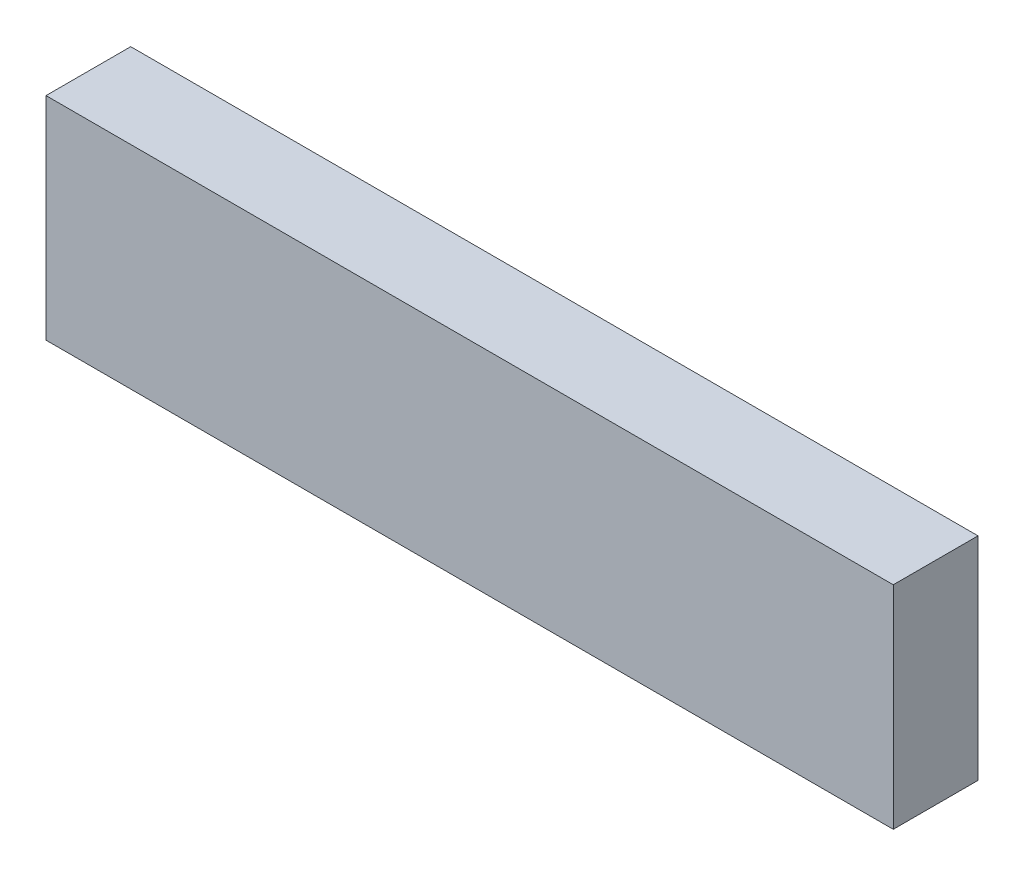
ISO-10303-21;
HEADER;
FILE_DESCRIPTION(('STEP AP214'),'2;1');
FILE_NAME('part.step','',(''),(''),'','','');
FILE_SCHEMA(('AUTOMOTIVE_DESIGN { 1 0 10303 214 1 1 1 1 }'));
ENDSEC;
DATA;
#1=APPLICATION_CONTEXT('core data for automotive mechanical design processes');
#2=APPLICATION_PROTOCOL_DEFINITION('international standard','automotive_design',2000,#1);
#3=PRODUCT_CONTEXT('',#1,'mechanical');
#4=PRODUCT('Part','Part','',(#3));
#5=PRODUCT_RELATED_PRODUCT_CATEGORY('part','',(#4));
#6=PRODUCT_DEFINITION_FORMATION('','',#4);
#7=PRODUCT_DEFINITION_CONTEXT('part definition',#1,'design');
#8=PRODUCT_DEFINITION('design','',#6,#7);
#9=PRODUCT_DEFINITION_SHAPE('','',#8);
#10=(LENGTH_UNIT() NAMED_UNIT(*) SI_UNIT(.MILLI.,.METRE.));
#11=(NAMED_UNIT(*) PLANE_ANGLE_UNIT() SI_UNIT($,.RADIAN.));
#12=(NAMED_UNIT(*) SI_UNIT($,.STERADIAN.) SOLID_ANGLE_UNIT());
#13=UNCERTAINTY_MEASURE_WITH_UNIT(LENGTH_MEASURE(1.E-05),#10,'distance_accuracy_value','');
#14=(GEOMETRIC_REPRESENTATION_CONTEXT(3) GLOBAL_UNCERTAINTY_ASSIGNED_CONTEXT((#13)) GLOBAL_UNIT_ASSIGNED_CONTEXT((#10,
#11,#12)) REPRESENTATION_CONTEXT('',''));
#15=CARTESIAN_POINT('',(0.,0.,0.));
#16=DIRECTION('',(0.,0.,1.));
#17=DIRECTION('',(1.,0.,0.));
#18=AXIS2_PLACEMENT_3D('',#15,#16,#17);
#19=CARTESIAN_POINT('',(-5.99999999999999,-50.01,55.8));
#20=DIRECTION('',(0.,0.,-1.));
#21=DIRECTION('',(-1.,0.,0.));
#22=AXIS2_PLACEMENT_3D('',#19,#20,#21);
#23=PLANE('',#22);
#24=DIRECTION('',(0.,1.,0.));
#25=VECTOR('',#24,1.);
#26=CARTESIAN_POINT('',(-5.99999999999999,-50.01,55.8));
#27=LINE('',#26,#25);
#28=CARTESIAN_POINT('',(-6.00000000000001,-50.,55.8));
#29=VERTEX_POINT('',#28);
#30=CARTESIAN_POINT('',(-6.00000000000001,-47.,55.8));
#31=VERTEX_POINT('',#30);
#32=EDGE_CURVE('E44',#29,#31,#27,.T.);
#33=ORIENTED_EDGE('',*,*,#32,.T.);
#34=DIRECTION('',(1.,0.,0.));
#35=VECTOR('',#34,1.);
#36=CARTESIAN_POINT('',(-300.,-47.,55.8));
#37=LINE('',#36,#35);
#38=CARTESIAN_POINT('',(6.00000000000006,-47.,55.8));
#39=VERTEX_POINT('',#38);
#40=EDGE_CURVE('E94',#31,#39,#37,.T.);
#41=ORIENTED_EDGE('',*,*,#40,.T.);
#42=DIRECTION('',(0.,1.,0.));
#43=VECTOR('',#42,1.);
#44=CARTESIAN_POINT('',(6.00000000000001,-50.01,55.8));
#45=LINE('',#44,#43);
#46=CARTESIAN_POINT('',(6.00000000000006,-50.,55.8));
#47=VERTEX_POINT('',#46);
#48=EDGE_CURVE('E11',#47,#39,#45,.T.);
#49=ORIENTED_EDGE('',*,*,#48,.F.);
#50=DIRECTION('',(-1.,0.,0.));
#51=VECTOR('',#50,1.);
#52=CARTESIAN_POINT('',(-300.,-50.,55.8));
#53=LINE('',#52,#51);
#54=EDGE_CURVE('E39',#47,#29,#53,.T.);
#55=ORIENTED_EDGE('',*,*,#54,.T.);
#56=EDGE_LOOP('',(#33,#41,#49,#55));
#57=FACE_BOUND('',#56,.T.);
#58=ADVANCED_FACE('F35',(#57),#23,.T.);
#59=CARTESIAN_POINT('',(-5.99999999999999,-50.01,57.));
#60=DIRECTION('',(-1.,0.,0.));
#61=DIRECTION('',(0.,0.,1.));
#62=AXIS2_PLACEMENT_3D('',#59,#60,#61);
#63=PLANE('',#62);
#64=DIRECTION('',(0.,1.,0.));
#65=VECTOR('',#64,1.);
#66=CARTESIAN_POINT('',(-5.99999999999999,-50.01,57.));
#67=LINE('',#66,#65);
#68=CARTESIAN_POINT('',(-6.00000000000001,-50.,57.));
#69=VERTEX_POINT('',#68);
#70=CARTESIAN_POINT('',(-6.00000000000001,-47.,57.));
#71=VERTEX_POINT('',#70);
#72=EDGE_CURVE('E73',#69,#71,#67,.T.);
#73=ORIENTED_EDGE('',*,*,#72,.T.);
#74=DIRECTION('',(0.,0.,-1.));
#75=VECTOR('',#74,1.);
#76=CARTESIAN_POINT('',(-6.00000000000001,-47.,3.));
#77=LINE('',#76,#75);
#78=EDGE_CURVE('E77',#71,#31,#77,.T.);
#79=ORIENTED_EDGE('',*,*,#78,.T.);
#80=ORIENTED_EDGE('',*,*,#32,.F.);
#81=DIRECTION('',(0.,0.,1.));
#82=VECTOR('',#81,1.);
#83=CARTESIAN_POINT('',(-6.00000000000001,-50.,60.));
#84=LINE('',#83,#82);
#85=EDGE_CURVE('E79',#29,#69,#84,.T.);
#86=ORIENTED_EDGE('',*,*,#85,.T.);
#87=EDGE_LOOP('',(#73,#79,#80,#86));
#88=FACE_BOUND('',#87,.T.);
#89=ADVANCED_FACE('F75',(#88),#63,.T.);
#90=CARTESIAN_POINT('',(6.00000000000001,-50.01,57.));
#91=DIRECTION('',(1.,0.,0.));
#92=DIRECTION('',(0.,0.,-1.));
#93=AXIS2_PLACEMENT_3D('',#90,#91,#92);
#94=PLANE('',#93);
#95=ORIENTED_EDGE('',*,*,#48,.T.);
#96=DIRECTION('',(0.,0.,1.));
#97=VECTOR('',#96,1.);
#98=CARTESIAN_POINT('',(6.00000000000001,-47.,3.));
#99=LINE('',#98,#97);
#100=CARTESIAN_POINT('',(6.00000000000001,-47.,57.));
#101=VERTEX_POINT('',#100);
#102=EDGE_CURVE('E91',#39,#101,#99,.T.);
#103=ORIENTED_EDGE('',*,*,#102,.T.);
#104=DIRECTION('',(0.,1.,0.));
#105=VECTOR('',#104,1.);
#106=CARTESIAN_POINT('',(6.00000000000001,-50.01,57.));
#107=LINE('',#106,#105);
#108=CARTESIAN_POINT('',(6.00000000000001,-50.,57.));
#109=VERTEX_POINT('',#108);
#110=EDGE_CURVE('E83',#109,#101,#107,.T.);
#111=ORIENTED_EDGE('',*,*,#110,.F.);
#112=DIRECTION('',(0.,0.,-1.));
#113=VECTOR('',#112,1.);
#114=CARTESIAN_POINT('',(6.00000000000001,-50.,60.));
#115=LINE('',#114,#113);
#116=EDGE_CURVE('E102',#109,#47,#115,.T.);
#117=ORIENTED_EDGE('',*,*,#116,.T.);
#118=EDGE_LOOP('',(#95,#103,#111,#117));
#119=FACE_BOUND('',#118,.T.);
#120=ADVANCED_FACE('F113',(#119),#94,.T.);
#121=CARTESIAN_POINT('',(-5.99999999999999,-50.01,57.));
#122=DIRECTION('',(0.,0.,1.));
#123=DIRECTION('',(1.,0.,0.));
#124=AXIS2_PLACEMENT_3D('',#121,#122,#123);
#125=PLANE('',#124);
#126=ORIENTED_EDGE('',*,*,#110,.T.);
#127=DIRECTION('',(-1.,0.,0.));
#128=VECTOR('',#127,1.);
#129=CARTESIAN_POINT('',(-300.,-47.,57.));
#130=LINE('',#129,#128);
#131=EDGE_CURVE('E86',#101,#71,#130,.T.);
#132=ORIENTED_EDGE('',*,*,#131,.T.);
#133=ORIENTED_EDGE('',*,*,#72,.F.);
#134=DIRECTION('',(1.,0.,0.));
#135=VECTOR('',#134,1.);
#136=CARTESIAN_POINT('',(-300.,-50.,57.));
#137=LINE('',#136,#135);
#138=EDGE_CURVE('E101',#69,#109,#137,.T.);
#139=ORIENTED_EDGE('',*,*,#138,.T.);
#140=EDGE_LOOP('',(#126,#132,#133,#139));
#141=FACE_BOUND('',#140,.T.);
#142=ADVANCED_FACE('F87',(#141),#125,.T.);
#143=CARTESIAN_POINT('',(-300.,-50.,60.));
#144=DIRECTION('',(0.,1.,0.));
#145=DIRECTION('',(0.,0.,1.));
#146=AXIS2_PLACEMENT_3D('',#143,#144,#145);
#147=PLANE('',#146);
#148=ORIENTED_EDGE('',*,*,#85,.F.);
#149=ORIENTED_EDGE('',*,*,#54,.F.);
#150=ORIENTED_EDGE('',*,*,#116,.F.);
#151=ORIENTED_EDGE('',*,*,#138,.F.);
#152=EDGE_LOOP('',(#148,#149,#150,#151));
#153=FACE_BOUND('',#152,.T.);
#154=ADVANCED_FACE('F107',(#153),#147,.F.);
#155=CARTESIAN_POINT('',(-300.,-47.,3.));
#156=DIRECTION('',(0.,-1.,0.));
#157=DIRECTION('',(0.,0.,-1.));
#158=AXIS2_PLACEMENT_3D('',#155,#156,#157);
#159=PLANE('',#158);
#160=ORIENTED_EDGE('',*,*,#78,.F.);
#161=ORIENTED_EDGE('',*,*,#131,.F.);
#162=ORIENTED_EDGE('',*,*,#102,.F.);
#163=ORIENTED_EDGE('',*,*,#40,.F.);
#164=EDGE_LOOP('',(#160,#161,#162,#163));
#165=FACE_BOUND('',#164,.T.);
#166=ADVANCED_FACE('F37',(#165),#159,.F.);
#167=CLOSED_SHELL('',(#58,#89,#120,#142,#154,#166));
#168=MANIFOLD_SOLID_BREP('B2',#167);
#169=ADVANCED_BREP_SHAPE_REPRESENTATION('',(#18,#168),#14);
#170=SHAPE_DEFINITION_REPRESENTATION(#9,#169);
ENDSEC;
END-ISO-10303-21;
